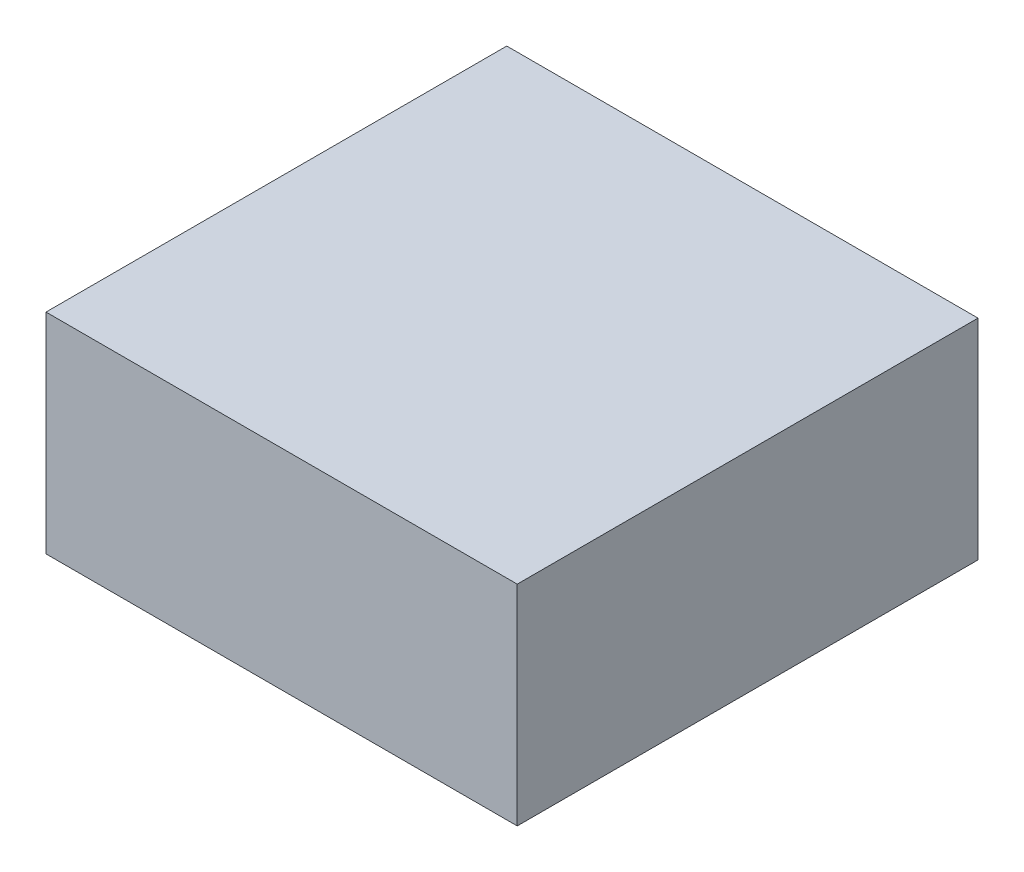
ISO-10303-21;
HEADER;
FILE_DESCRIPTION(('STEP AP214'),'2;1');
FILE_NAME('part.step','',(''),(''),'','','');
FILE_SCHEMA(('AUTOMOTIVE_DESIGN { 1 0 10303 214 1 1 1 1 }'));
ENDSEC;
DATA;
#1=APPLICATION_CONTEXT('core data for automotive mechanical design processes');
#2=APPLICATION_PROTOCOL_DEFINITION('international standard','automotive_design',2000,#1);
#3=PRODUCT_CONTEXT('',#1,'mechanical');
#4=PRODUCT('Part','Part','',(#3));
#5=PRODUCT_RELATED_PRODUCT_CATEGORY('part','',(#4));
#6=PRODUCT_DEFINITION_FORMATION('','',#4);
#7=PRODUCT_DEFINITION_CONTEXT('part definition',#1,'design');
#8=PRODUCT_DEFINITION('design','',#6,#7);
#9=PRODUCT_DEFINITION_SHAPE('','',#8);
#10=(LENGTH_UNIT() NAMED_UNIT(*) SI_UNIT(.MILLI.,.METRE.));
#11=(NAMED_UNIT(*) PLANE_ANGLE_UNIT() SI_UNIT($,.RADIAN.));
#12=(NAMED_UNIT(*) SI_UNIT($,.STERADIAN.) SOLID_ANGLE_UNIT());
#13=UNCERTAINTY_MEASURE_WITH_UNIT(LENGTH_MEASURE(1.E-05),#10,'distance_accuracy_value','');
#14=(GEOMETRIC_REPRESENTATION_CONTEXT(3) GLOBAL_UNCERTAINTY_ASSIGNED_CONTEXT((#13)) GLOBAL_UNIT_ASSIGNED_CONTEXT((#10,
#11,#12)) REPRESENTATION_CONTEXT('',''));
#15=CARTESIAN_POINT('',(0.,0.,0.));
#16=DIRECTION('',(0.,0.,1.));
#17=DIRECTION('',(1.,0.,0.));
#18=AXIS2_PLACEMENT_3D('',#15,#16,#17);
#19=CARTESIAN_POINT('',(-0.5715,0.254,0.));
#20=DIRECTION('',(0.,1.,0.));
#21=DIRECTION('',(0.,0.,1.));
#22=AXIS2_PLACEMENT_3D('',#19,#20,#21);
#23=PLANE('',#22);
#24=DIRECTION('',(0.,0.,-1.));
#25=VECTOR('',#24,1.);
#26=CARTESIAN_POINT('',(0.5715,0.254,0.));
#27=LINE('',#26,#25);
#28=CARTESIAN_POINT('',(0.5715,0.254,0.));
#29=VERTEX_POINT('',#28);
#30=CARTESIAN_POINT('',(0.5715,0.254,1.1176));
#31=VERTEX_POINT('',#30);
#32=EDGE_CURVE('E19',#29,#31,#27,.F.);
#33=ORIENTED_EDGE('',*,*,#32,.F.);
#34=DIRECTION('',(1.,0.,0.));
#35=VECTOR('',#34,1.);
#36=CARTESIAN_POINT('',(0.5715,0.254,0.));
#37=LINE('',#36,#35);
#38=CARTESIAN_POINT('',(-0.5715,0.254,0.));
#39=VERTEX_POINT('',#38);
#40=EDGE_CURVE('E79',#29,#39,#37,.F.);
#41=ORIENTED_EDGE('',*,*,#40,.T.);
#42=DIRECTION('',(0.,0.,1.));
#43=VECTOR('',#42,1.);
#44=CARTESIAN_POINT('',(-0.5715,0.254,0.));
#45=LINE('',#44,#43);
#46=CARTESIAN_POINT('',(-0.5715,0.254,1.1176));
#47=VERTEX_POINT('',#46);
#48=EDGE_CURVE('E67',#47,#39,#45,.F.);
#49=ORIENTED_EDGE('',*,*,#48,.F.);
#50=DIRECTION('',(1.,0.,0.));
#51=VECTOR('',#50,1.);
#52=CARTESIAN_POINT('',(0.5715,0.254,1.1176));
#53=LINE('',#52,#51);
#54=EDGE_CURVE('E55',#31,#47,#53,.F.);
#55=ORIENTED_EDGE('',*,*,#54,.F.);
#56=EDGE_LOOP('',(#33,#41,#49,#55));
#57=FACE_BOUND('',#56,.T.);
#58=ADVANCED_FACE('F16',(#57),#23,.T.);
#59=CARTESIAN_POINT('',(0.5715,0.254,0.));
#60=DIRECTION('',(1.,0.,0.));
#61=DIRECTION('',(0.,0.,-1.));
#62=AXIS2_PLACEMENT_3D('',#59,#60,#61);
#63=PLANE('',#62);
#64=DIRECTION('',(0.,0.,-1.));
#65=VECTOR('',#64,1.);
#66=CARTESIAN_POINT('',(0.5715,-0.25399746,0.));
#67=LINE('',#66,#65);
#68=CARTESIAN_POINT('',(0.5715,-0.25399746,0.));
#69=VERTEX_POINT('',#68);
#70=CARTESIAN_POINT('',(0.5715,-0.25399746,1.1176));
#71=VERTEX_POINT('',#70);
#72=EDGE_CURVE('E82',#69,#71,#67,.F.);
#73=ORIENTED_EDGE('',*,*,#72,.F.);
#74=DIRECTION('',(0.,1.,0.));
#75=VECTOR('',#74,1.);
#76=CARTESIAN_POINT('',(0.5715,-0.25399746,0.));
#77=LINE('',#76,#75);
#78=EDGE_CURVE('E64',#69,#29,#77,.T.);
#79=ORIENTED_EDGE('',*,*,#78,.T.);
#80=ORIENTED_EDGE('',*,*,#32,.T.);
#81=DIRECTION('',(0.,1.,0.));
#82=VECTOR('',#81,1.);
#83=CARTESIAN_POINT('',(0.5715,-0.25399746,1.1176));
#84=LINE('',#83,#82);
#85=EDGE_CURVE('E61',#71,#31,#84,.T.);
#86=ORIENTED_EDGE('',*,*,#85,.F.);
#87=EDGE_LOOP('',(#73,#79,#80,#86));
#88=FACE_BOUND('',#87,.T.);
#89=ADVANCED_FACE('F60',(#88),#63,.T.);
#90=CARTESIAN_POINT('',(0.5715,-0.25399746,1.1176));
#91=DIRECTION('',(0.,0.,1.));
#92=DIRECTION('',(1.,0.,0.));
#93=AXIS2_PLACEMENT_3D('',#90,#91,#92);
#94=PLANE('',#93);
#95=DIRECTION('',(0.,1.,0.));
#96=VECTOR('',#95,1.);
#97=CARTESIAN_POINT('',(-0.5715,-0.25399746,1.1176));
#98=LINE('',#97,#96);
#99=CARTESIAN_POINT('',(-0.5715,-0.25399746,1.1176));
#100=VERTEX_POINT('',#99);
#101=EDGE_CURVE('E69',#100,#47,#98,.T.);
#102=ORIENTED_EDGE('',*,*,#101,.F.);
#103=DIRECTION('',(1.,0.,0.));
#104=VECTOR('',#103,1.);
#105=CARTESIAN_POINT('',(0.5715,-0.25399746,1.1176));
#106=LINE('',#105,#104);
#107=EDGE_CURVE('E73',#71,#100,#106,.F.);
#108=ORIENTED_EDGE('',*,*,#107,.F.);
#109=ORIENTED_EDGE('',*,*,#85,.T.);
#110=ORIENTED_EDGE('',*,*,#54,.T.);
#111=EDGE_LOOP('',(#102,#108,#109,#110));
#112=FACE_BOUND('',#111,.T.);
#113=ADVANCED_FACE('F71',(#112),#94,.T.);
#114=CARTESIAN_POINT('',(-0.5715,-0.25399746,0.));
#115=DIRECTION('',(-1.,0.,0.));
#116=DIRECTION('',(0.,0.,1.));
#117=AXIS2_PLACEMENT_3D('',#114,#115,#116);
#118=PLANE('',#117);
#119=ORIENTED_EDGE('',*,*,#48,.T.);
#120=DIRECTION('',(0.,1.,0.));
#121=VECTOR('',#120,1.);
#122=CARTESIAN_POINT('',(-0.5715,-0.25399746,0.));
#123=LINE('',#122,#121);
#124=CARTESIAN_POINT('',(-0.5715,-0.25399746,0.));
#125=VERTEX_POINT('',#124);
#126=EDGE_CURVE('E34',#39,#125,#123,.F.);
#127=ORIENTED_EDGE('',*,*,#126,.T.);
#128=DIRECTION('',(0.,0.,-1.));
#129=VECTOR('',#128,1.);
#130=CARTESIAN_POINT('',(-0.5715,-0.25399746,0.));
#131=LINE('',#130,#129);
#132=EDGE_CURVE('E25',#100,#125,#131,.T.);
#133=ORIENTED_EDGE('',*,*,#132,.F.);
#134=ORIENTED_EDGE('',*,*,#101,.T.);
#135=EDGE_LOOP('',(#119,#127,#133,#134));
#136=FACE_BOUND('',#135,.T.);
#137=ADVANCED_FACE('F88',(#136),#118,.T.);
#138=CARTESIAN_POINT('',(0.5715,-0.25399746,0.));
#139=DIRECTION('',(0.,0.,1.));
#140=DIRECTION('',(1.,0.,0.));
#141=AXIS2_PLACEMENT_3D('',#138,#139,#140);
#142=PLANE('',#141);
#143=ORIENTED_EDGE('',*,*,#126,.F.);
#144=ORIENTED_EDGE('',*,*,#40,.F.);
#145=ORIENTED_EDGE('',*,*,#78,.F.);
#146=DIRECTION('',(1.,0.,0.));
#147=VECTOR('',#146,1.);
#148=CARTESIAN_POINT('',(0.5715,-0.25399746,0.));
#149=LINE('',#148,#147);
#150=EDGE_CURVE('E11',#125,#69,#149,.T.);
#151=ORIENTED_EDGE('',*,*,#150,.F.);
#152=EDGE_LOOP('',(#143,#144,#145,#151));
#153=FACE_BOUND('',#152,.T.);
#154=ADVANCED_FACE('F90',(#153),#142,.F.);
#155=CARTESIAN_POINT('',(0.5715,-0.25399746,0.));
#156=DIRECTION('',(0.,-1.,0.));
#157=DIRECTION('',(0.,0.,-1.));
#158=AXIS2_PLACEMENT_3D('',#155,#156,#157);
#159=PLANE('',#158);
#160=ORIENTED_EDGE('',*,*,#132,.T.);
#161=ORIENTED_EDGE('',*,*,#150,.T.);
#162=ORIENTED_EDGE('',*,*,#72,.T.);
#163=ORIENTED_EDGE('',*,*,#107,.T.);
#164=EDGE_LOOP('',(#160,#161,#162,#163));
#165=FACE_BOUND('',#164,.T.);
#166=ADVANCED_FACE('F87',(#165),#159,.T.);
#167=CLOSED_SHELL('',(#58,#89,#113,#137,#154,#166));
#168=MANIFOLD_SOLID_BREP('B1',#167);
#169=ADVANCED_BREP_SHAPE_REPRESENTATION('',(#18,#168),#14);
#170=SHAPE_DEFINITION_REPRESENTATION(#9,#169);
ENDSEC;
END-ISO-10303-21;
